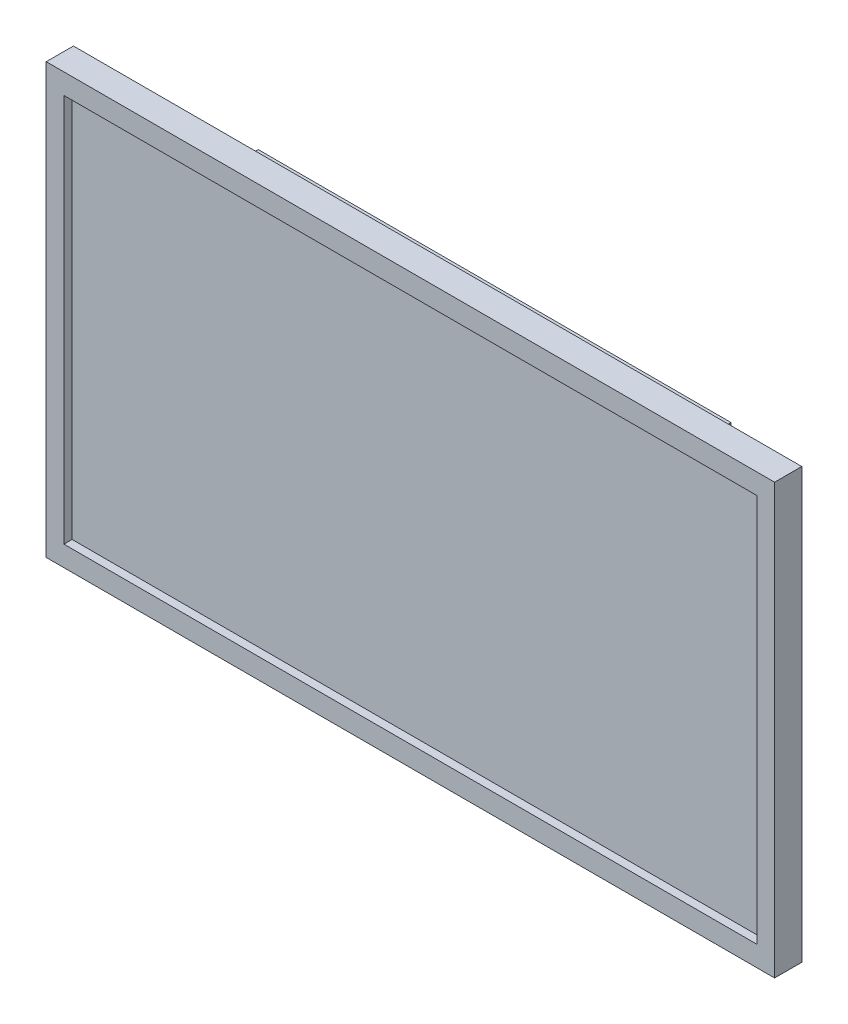
ISO-10303-21;
HEADER;
FILE_DESCRIPTION(('STEP AP214'),'2;1');
FILE_NAME('part.step','',(''),(''),'','','');
FILE_SCHEMA(('AUTOMOTIVE_DESIGN { 1 0 10303 214 1 1 1 1 }'));
ENDSEC;
DATA;
#1=APPLICATION_CONTEXT('core data for automotive mechanical design processes');
#2=APPLICATION_PROTOCOL_DEFINITION('international standard','automotive_design',2000,#1);
#3=PRODUCT_CONTEXT('',#1,'mechanical');
#4=PRODUCT('Part','Part','',(#3));
#5=PRODUCT_RELATED_PRODUCT_CATEGORY('part','',(#4));
#6=PRODUCT_DEFINITION_FORMATION('','',#4);
#7=PRODUCT_DEFINITION_CONTEXT('part definition',#1,'design');
#8=PRODUCT_DEFINITION('design','',#6,#7);
#9=PRODUCT_DEFINITION_SHAPE('','',#8);
#10=(LENGTH_UNIT() NAMED_UNIT(*) SI_UNIT(.MILLI.,.METRE.));
#11=(NAMED_UNIT(*) PLANE_ANGLE_UNIT() SI_UNIT($,.RADIAN.));
#12=(NAMED_UNIT(*) SI_UNIT($,.STERADIAN.) SOLID_ANGLE_UNIT());
#13=UNCERTAINTY_MEASURE_WITH_UNIT(LENGTH_MEASURE(1.E-05),#10,'distance_accuracy_value','');
#14=(GEOMETRIC_REPRESENTATION_CONTEXT(3) GLOBAL_UNCERTAINTY_ASSIGNED_CONTEXT((#13)) GLOBAL_UNIT_ASSIGNED_CONTEXT((#10,
#11,#12)) REPRESENTATION_CONTEXT('',''));
#15=CARTESIAN_POINT('',(0.,0.,0.));
#16=DIRECTION('',(0.,0.,1.));
#17=DIRECTION('',(1.,0.,0.));
#18=AXIS2_PLACEMENT_3D('',#15,#16,#17);
#19=CARTESIAN_POINT('',(134.,79.,-10.));
#20=DIRECTION('',(0.,1.,0.));
#21=DIRECTION('',(0.,0.,1.));
#22=AXIS2_PLACEMENT_3D('',#19,#20,#21);
#23=PLANE('',#22);
#24=DIRECTION('',(-1.,0.,0.));
#25=VECTOR('',#24,1.);
#26=CARTESIAN_POINT('',(134.,79.,0.));
#27=LINE('',#26,#25);
#28=CARTESIAN_POINT('',(134.,79.,0.));
#29=VERTEX_POINT('',#28);
#30=CARTESIAN_POINT('',(-134.,79.,0.));
#31=VERTEX_POINT('',#30);
#32=EDGE_CURVE('E195',#29,#31,#27,.T.);
#33=ORIENTED_EDGE('',*,*,#32,.F.);
#34=DIRECTION('',(0.,0.,1.));
#35=VECTOR('',#34,1.);
#36=CARTESIAN_POINT('',(134.,79.,-10.));
#37=LINE('',#36,#35);
#38=CARTESIAN_POINT('',(134.,79.,-10.));
#39=VERTEX_POINT('',#38);
#40=EDGE_CURVE('E11',#39,#29,#37,.T.);
#41=ORIENTED_EDGE('',*,*,#40,.F.);
#42=DIRECTION('',(-1.,0.,0.));
#43=VECTOR('',#42,1.);
#44=CARTESIAN_POINT('',(134.,79.,-10.));
#45=LINE('',#44,#43);
#46=CARTESIAN_POINT('',(-134.,79.,-10.));
#47=VERTEX_POINT('',#46);
#48=EDGE_CURVE('E196',#39,#47,#45,.T.);
#49=ORIENTED_EDGE('',*,*,#48,.T.);
#50=DIRECTION('',(0.,0.,1.));
#51=VECTOR('',#50,1.);
#52=CARTESIAN_POINT('',(-134.,79.,-10.));
#53=LINE('',#52,#51);
#54=EDGE_CURVE('E38',#47,#31,#53,.T.);
#55=ORIENTED_EDGE('',*,*,#54,.T.);
#56=EDGE_LOOP('',(#33,#41,#49,#55));
#57=FACE_BOUND('',#56,.T.);
#58=ADVANCED_FACE('F35',(#57),#23,.T.);
#59=CARTESIAN_POINT('',(134.,-79.,-10.));
#60=DIRECTION('',(1.,0.,0.));
#61=DIRECTION('',(0.,1.,0.));
#62=AXIS2_PLACEMENT_3D('',#59,#60,#61);
#63=PLANE('',#62);
#64=DIRECTION('',(0.,1.,0.));
#65=VECTOR('',#64,1.);
#66=CARTESIAN_POINT('',(134.,-79.,0.));
#67=LINE('',#66,#65);
#68=CARTESIAN_POINT('',(134.,-79.,0.));
#69=VERTEX_POINT('',#68);
#70=EDGE_CURVE('E200',#69,#29,#67,.T.);
#71=ORIENTED_EDGE('',*,*,#70,.F.);
#72=DIRECTION('',(0.,0.,1.));
#73=VECTOR('',#72,1.);
#74=CARTESIAN_POINT('',(134.,-79.,-10.));
#75=LINE('',#74,#73);
#76=CARTESIAN_POINT('',(134.,-79.,-10.));
#77=VERTEX_POINT('',#76);
#78=EDGE_CURVE('E43',#77,#69,#75,.T.);
#79=ORIENTED_EDGE('',*,*,#78,.F.);
#80=DIRECTION('',(0.,1.,0.));
#81=VECTOR('',#80,1.);
#82=CARTESIAN_POINT('',(134.,-79.,-10.));
#83=LINE('',#82,#81);
#84=EDGE_CURVE('E206',#77,#39,#83,.T.);
#85=ORIENTED_EDGE('',*,*,#84,.T.);
#86=ORIENTED_EDGE('',*,*,#40,.T.);
#87=EDGE_LOOP('',(#71,#79,#85,#86));
#88=FACE_BOUND('',#87,.T.);
#89=ADVANCED_FACE('F232',(#88),#63,.T.);
#90=CARTESIAN_POINT('',(-134.,-79.,-10.));
#91=DIRECTION('',(0.,-1.,0.));
#92=DIRECTION('',(0.,0.,-1.));
#93=AXIS2_PLACEMENT_3D('',#90,#91,#92);
#94=PLANE('',#93);
#95=DIRECTION('',(1.,0.,0.));
#96=VECTOR('',#95,1.);
#97=CARTESIAN_POINT('',(-134.,-79.,0.));
#98=LINE('',#97,#96);
#99=CARTESIAN_POINT('',(-134.,-79.,0.));
#100=VERTEX_POINT('',#99);
#101=EDGE_CURVE('E214',#100,#69,#98,.T.);
#102=ORIENTED_EDGE('',*,*,#101,.F.);
#103=DIRECTION('',(0.,0.,1.));
#104=VECTOR('',#103,1.);
#105=CARTESIAN_POINT('',(-134.,-79.,-10.));
#106=LINE('',#105,#104);
#107=CARTESIAN_POINT('',(-134.,-79.,-10.));
#108=VERTEX_POINT('',#107);
#109=EDGE_CURVE('E219',#108,#100,#106,.T.);
#110=ORIENTED_EDGE('',*,*,#109,.F.);
#111=DIRECTION('',(1.,0.,0.));
#112=VECTOR('',#111,1.);
#113=CARTESIAN_POINT('',(-134.,-79.,-10.));
#114=LINE('',#113,#112);
#115=EDGE_CURVE('E203',#108,#77,#114,.T.);
#116=ORIENTED_EDGE('',*,*,#115,.T.);
#117=ORIENTED_EDGE('',*,*,#78,.T.);
#118=EDGE_LOOP('',(#102,#110,#116,#117));
#119=FACE_BOUND('',#118,.T.);
#120=ADVANCED_FACE('F238',(#119),#94,.T.);
#121=CARTESIAN_POINT('',(-134.,79.,-10.));
#122=DIRECTION('',(-1.,0.,0.));
#123=DIRECTION('',(0.,-1.,0.));
#124=AXIS2_PLACEMENT_3D('',#121,#122,#123);
#125=PLANE('',#124);
#126=DIRECTION('',(0.,-1.,0.));
#127=VECTOR('',#126,1.);
#128=CARTESIAN_POINT('',(-134.,79.,0.));
#129=LINE('',#128,#127);
#130=EDGE_CURVE('E211',#31,#100,#129,.T.);
#131=ORIENTED_EDGE('',*,*,#130,.F.);
#132=ORIENTED_EDGE('',*,*,#54,.F.);
#133=DIRECTION('',(0.,-1.,0.));
#134=VECTOR('',#133,1.);
#135=CARTESIAN_POINT('',(-134.,79.,-10.));
#136=LINE('',#135,#134);
#137=EDGE_CURVE('E199',#47,#108,#136,.T.);
#138=ORIENTED_EDGE('',*,*,#137,.T.);
#139=ORIENTED_EDGE('',*,*,#109,.T.);
#140=EDGE_LOOP('',(#131,#132,#138,#139));
#141=FACE_BOUND('',#140,.T.);
#142=ADVANCED_FACE('F227',(#141),#125,.T.);
#143=CARTESIAN_POINT('',(0.,0.,-10.));
#144=DIRECTION('',(0.,0.,1.));
#145=DIRECTION('',(1.,0.,0.));
#146=AXIS2_PLACEMENT_3D('',#143,#144,#145);
#147=PLANE('',#146);
#148=DIRECTION('',(0.,1.,0.));
#149=VECTOR('',#148,1.);
#150=CARTESIAN_POINT('',(87.,0.,-10.));
#151=LINE('',#150,#149);
#152=CARTESIAN_POINT('',(87.,-59.,-10.));
#153=VERTEX_POINT('',#152);
#154=CARTESIAN_POINT('',(87.,59.,-10.));
#155=VERTEX_POINT('',#154);
#156=EDGE_CURVE('E189',#153,#155,#151,.T.);
#157=ORIENTED_EDGE('',*,*,#156,.T.);
#158=DIRECTION('',(-1.,0.,0.));
#159=VECTOR('',#158,1.);
#160=CARTESIAN_POINT('',(0.,59.,-10.));
#161=LINE('',#160,#159);
#162=CARTESIAN_POINT('',(-87.,59.,-10.));
#163=VERTEX_POINT('',#162);
#164=EDGE_CURVE('E192',#155,#163,#161,.T.);
#165=ORIENTED_EDGE('',*,*,#164,.T.);
#166=DIRECTION('',(0.,-1.,0.));
#167=VECTOR('',#166,1.);
#168=CARTESIAN_POINT('',(-87.,0.,-10.));
#169=LINE('',#168,#167);
#170=CARTESIAN_POINT('',(-87.,-59.,-10.));
#171=VERTEX_POINT('',#170);
#172=EDGE_CURVE('E177',#163,#171,#169,.T.);
#173=ORIENTED_EDGE('',*,*,#172,.T.);
#174=DIRECTION('',(1.,0.,0.));
#175=VECTOR('',#174,1.);
#176=CARTESIAN_POINT('',(0.,-59.,-10.));
#177=LINE('',#176,#175);
#178=EDGE_CURVE('E186',#171,#153,#177,.T.);
#179=ORIENTED_EDGE('',*,*,#178,.T.);
#180=EDGE_LOOP('',(#157,#165,#173,#179));
#181=FACE_BOUND('',#180,.T.);
#182=ORIENTED_EDGE('',*,*,#48,.F.);
#183=ORIENTED_EDGE('',*,*,#84,.F.);
#184=ORIENTED_EDGE('',*,*,#115,.F.);
#185=ORIENTED_EDGE('',*,*,#137,.F.);
#186=EDGE_LOOP('',(#182,#183,#184,#185));
#187=FACE_BOUND('',#186,.T.);
#188=ADVANCED_FACE('F235',(#181,#187),#147,.F.);
#189=CARTESIAN_POINT('',(0.,0.,0.));
#190=DIRECTION('',(0.,0.,1.));
#191=DIRECTION('',(1.,0.,0.));
#192=AXIS2_PLACEMENT_3D('',#189,#190,#191);
#193=PLANE('',#192);
#194=DIRECTION('',(0.,-1.,0.));
#195=VECTOR('',#194,1.);
#196=CARTESIAN_POINT('',(-127.5,71.5,0.));
#197=LINE('',#196,#195);
#198=CARTESIAN_POINT('',(-127.5,71.5,0.));
#199=VERTEX_POINT('',#198);
#200=CARTESIAN_POINT('',(-127.5,-71.5,0.));
#201=VERTEX_POINT('',#200);
#202=EDGE_CURVE('E51',#199,#201,#197,.T.);
#203=ORIENTED_EDGE('',*,*,#202,.F.);
#204=DIRECTION('',(-1.,0.,0.));
#205=VECTOR('',#204,1.);
#206=CARTESIAN_POINT('',(-127.5,71.5,0.));
#207=LINE('',#206,#205);
#208=CARTESIAN_POINT('',(127.5,71.5,0.));
#209=VERTEX_POINT('',#208);
#210=EDGE_CURVE('E144',#209,#199,#207,.T.);
#211=ORIENTED_EDGE('',*,*,#210,.F.);
#212=DIRECTION('',(0.,1.,0.));
#213=VECTOR('',#212,1.);
#214=CARTESIAN_POINT('',(127.5,71.5,0.));
#215=LINE('',#214,#213);
#216=CARTESIAN_POINT('',(127.5,-71.5,0.));
#217=VERTEX_POINT('',#216);
#218=EDGE_CURVE('E147',#217,#209,#215,.T.);
#219=ORIENTED_EDGE('',*,*,#218,.F.);
#220=DIRECTION('',(1.,0.,0.));
#221=VECTOR('',#220,1.);
#222=CARTESIAN_POINT('',(-127.5,-71.5,0.));
#223=LINE('',#222,#221);
#224=EDGE_CURVE('E153',#201,#217,#223,.T.);
#225=ORIENTED_EDGE('',*,*,#224,.F.);
#226=EDGE_LOOP('',(#203,#211,#219,#225));
#227=FACE_BOUND('',#226,.T.);
#228=ORIENTED_EDGE('',*,*,#32,.T.);
#229=ORIENTED_EDGE('',*,*,#130,.T.);
#230=ORIENTED_EDGE('',*,*,#101,.T.);
#231=ORIENTED_EDGE('',*,*,#70,.T.);
#232=EDGE_LOOP('',(#228,#229,#230,#231));
#233=FACE_BOUND('',#232,.T.);
#234=ADVANCED_FACE('F229',(#227,#233),#193,.T.);
#235=CARTESIAN_POINT('',(87.,59.,-31.));
#236=DIRECTION('',(0.,1.,0.));
#237=DIRECTION('',(0.,0.,1.));
#238=AXIS2_PLACEMENT_3D('',#235,#236,#237);
#239=PLANE('',#238);
#240=ORIENTED_EDGE('',*,*,#164,.F.);
#241=DIRECTION('',(0.,0.,1.));
#242=VECTOR('',#241,1.);
#243=CARTESIAN_POINT('',(87.,59.,-31.));
#244=LINE('',#243,#242);
#245=CARTESIAN_POINT('',(87.,59.,-31.));
#246=VERTEX_POINT('',#245);
#247=EDGE_CURVE('E174',#246,#155,#244,.T.);
#248=ORIENTED_EDGE('',*,*,#247,.F.);
#249=DIRECTION('',(-1.,0.,0.));
#250=VECTOR('',#249,1.);
#251=CARTESIAN_POINT('',(87.,59.,-31.));
#252=LINE('',#251,#250);
#253=CARTESIAN_POINT('',(-87.,59.,-31.));
#254=VERTEX_POINT('',#253);
#255=EDGE_CURVE('E159',#246,#254,#252,.T.);
#256=ORIENTED_EDGE('',*,*,#255,.T.);
#257=DIRECTION('',(0.,0.,1.));
#258=VECTOR('',#257,1.);
#259=CARTESIAN_POINT('',(-87.,59.,-31.));
#260=LINE('',#259,#258);
#261=EDGE_CURVE('E173',#254,#163,#260,.T.);
#262=ORIENTED_EDGE('',*,*,#261,.T.);
#263=EDGE_LOOP('',(#240,#248,#256,#262));
#264=FACE_BOUND('',#263,.T.);
#265=ADVANCED_FACE('F279',(#264),#239,.T.);
#266=CARTESIAN_POINT('',(87.,-59.,-31.));
#267=DIRECTION('',(1.,0.,0.));
#268=DIRECTION('',(0.,0.,-1.));
#269=AXIS2_PLACEMENT_3D('',#266,#267,#268);
#270=PLANE('',#269);
#271=ORIENTED_EDGE('',*,*,#156,.F.);
#272=DIRECTION('',(0.,0.,1.));
#273=VECTOR('',#272,1.);
#274=CARTESIAN_POINT('',(87.,-59.,-31.));
#275=LINE('',#274,#273);
#276=CARTESIAN_POINT('',(87.,-59.,-31.));
#277=VERTEX_POINT('',#276);
#278=EDGE_CURVE('E178',#277,#153,#275,.T.);
#279=ORIENTED_EDGE('',*,*,#278,.F.);
#280=DIRECTION('',(0.,1.,0.));
#281=VECTOR('',#280,1.);
#282=CARTESIAN_POINT('',(87.,-59.,-31.));
#283=LINE('',#282,#281);
#284=EDGE_CURVE('E170',#277,#246,#283,.T.);
#285=ORIENTED_EDGE('',*,*,#284,.T.);
#286=ORIENTED_EDGE('',*,*,#247,.T.);
#287=EDGE_LOOP('',(#271,#279,#285,#286));
#288=FACE_BOUND('',#287,.T.);
#289=ADVANCED_FACE('F284',(#288),#270,.T.);
#290=CARTESIAN_POINT('',(-87.,-59.,-31.));
#291=DIRECTION('',(0.,-1.,0.));
#292=DIRECTION('',(0.,0.,-1.));
#293=AXIS2_PLACEMENT_3D('',#290,#291,#292);
#294=PLANE('',#293);
#295=ORIENTED_EDGE('',*,*,#178,.F.);
#296=DIRECTION('',(0.,0.,1.));
#297=VECTOR('',#296,1.);
#298=CARTESIAN_POINT('',(-87.,-59.,-31.));
#299=LINE('',#298,#297);
#300=CARTESIAN_POINT('',(-87.,-59.,-31.));
#301=VERTEX_POINT('',#300);
#302=EDGE_CURVE('E59',#301,#171,#299,.T.);
#303=ORIENTED_EDGE('',*,*,#302,.F.);
#304=DIRECTION('',(1.,0.,0.));
#305=VECTOR('',#304,1.);
#306=CARTESIAN_POINT('',(-87.,-59.,-31.));
#307=LINE('',#306,#305);
#308=EDGE_CURVE('E167',#301,#277,#307,.T.);
#309=ORIENTED_EDGE('',*,*,#308,.T.);
#310=ORIENTED_EDGE('',*,*,#278,.T.);
#311=EDGE_LOOP('',(#295,#303,#309,#310));
#312=FACE_BOUND('',#311,.T.);
#313=ADVANCED_FACE('F294',(#312),#294,.T.);
#314=CARTESIAN_POINT('',(-87.,59.,-31.));
#315=DIRECTION('',(-1.,0.,0.));
#316=DIRECTION('',(0.,0.,1.));
#317=AXIS2_PLACEMENT_3D('',#314,#315,#316);
#318=PLANE('',#317);
#319=ORIENTED_EDGE('',*,*,#172,.F.);
#320=ORIENTED_EDGE('',*,*,#261,.F.);
#321=DIRECTION('',(0.,-1.,0.));
#322=VECTOR('',#321,1.);
#323=CARTESIAN_POINT('',(-87.,59.,-31.));
#324=LINE('',#323,#322);
#325=EDGE_CURVE('E165',#254,#301,#324,.T.);
#326=ORIENTED_EDGE('',*,*,#325,.T.);
#327=ORIENTED_EDGE('',*,*,#302,.T.);
#328=EDGE_LOOP('',(#319,#320,#326,#327));
#329=FACE_BOUND('',#328,.T.);
#330=ADVANCED_FACE('F304',(#329),#318,.T.);
#331=CARTESIAN_POINT('',(0.,0.,-31.));
#332=DIRECTION('',(0.,0.,1.));
#333=DIRECTION('',(1.,0.,0.));
#334=AXIS2_PLACEMENT_3D('',#331,#332,#333);
#335=PLANE('',#334);
#336=ORIENTED_EDGE('',*,*,#255,.F.);
#337=ORIENTED_EDGE('',*,*,#284,.F.);
#338=ORIENTED_EDGE('',*,*,#308,.F.);
#339=ORIENTED_EDGE('',*,*,#325,.F.);
#340=EDGE_LOOP('',(#336,#337,#338,#339));
#341=FACE_BOUND('',#340,.T.);
#342=ADVANCED_FACE('F314',(#341),#335,.F.);
#343=CARTESIAN_POINT('',(-127.5,71.5,-3.));
#344=DIRECTION('',(-1.,0.,0.));
#345=DIRECTION('',(0.,0.,1.));
#346=AXIS2_PLACEMENT_3D('',#343,#344,#345);
#347=PLANE('',#346);
#348=ORIENTED_EDGE('',*,*,#202,.T.);
#349=DIRECTION('',(0.,0.,1.));
#350=VECTOR('',#349,1.);
#351=CARTESIAN_POINT('',(-127.5,-71.5,-3.));
#352=LINE('',#351,#350);
#353=CARTESIAN_POINT('',(-127.5,-71.5,-3.));
#354=VERTEX_POINT('',#353);
#355=EDGE_CURVE('E122',#354,#201,#352,.T.);
#356=ORIENTED_EDGE('',*,*,#355,.F.);
#357=DIRECTION('',(0.,-1.,0.));
#358=VECTOR('',#357,1.);
#359=CARTESIAN_POINT('',(-127.5,71.5,-3.));
#360=LINE('',#359,#358);
#361=CARTESIAN_POINT('',(-127.5,71.5,-3.));
#362=VERTEX_POINT('',#361);
#363=EDGE_CURVE('E126',#362,#354,#360,.T.);
#364=ORIENTED_EDGE('',*,*,#363,.F.);
#365=DIRECTION('',(0.,0.,1.));
#366=VECTOR('',#365,1.);
#367=CARTESIAN_POINT('',(-127.5,71.5,-3.));
#368=LINE('',#367,#366);
#369=EDGE_CURVE('E157',#362,#199,#368,.T.);
#370=ORIENTED_EDGE('',*,*,#369,.T.);
#371=EDGE_LOOP('',(#348,#356,#364,#370));
#372=FACE_BOUND('',#371,.T.);
#373=ADVANCED_FACE('F124',(#372),#347,.F.);
#374=CARTESIAN_POINT('',(-127.5,71.5,-3.));
#375=DIRECTION('',(0.,1.,0.));
#376=DIRECTION('',(0.,0.,1.));
#377=AXIS2_PLACEMENT_3D('',#374,#375,#376);
#378=PLANE('',#377);
#379=ORIENTED_EDGE('',*,*,#210,.T.);
#380=ORIENTED_EDGE('',*,*,#369,.F.);
#381=DIRECTION('',(-1.,0.,0.));
#382=VECTOR('',#381,1.);
#383=CARTESIAN_POINT('',(-127.5,71.5,-3.));
#384=LINE('',#383,#382);
#385=CARTESIAN_POINT('',(127.5,71.5,-3.));
#386=VERTEX_POINT('',#385);
#387=EDGE_CURVE('E132',#386,#362,#384,.T.);
#388=ORIENTED_EDGE('',*,*,#387,.F.);
#389=DIRECTION('',(0.,0.,1.));
#390=VECTOR('',#389,1.);
#391=CARTESIAN_POINT('',(127.5,71.5,-3.));
#392=LINE('',#391,#390);
#393=EDGE_CURVE('E160',#386,#209,#392,.T.);
#394=ORIENTED_EDGE('',*,*,#393,.T.);
#395=EDGE_LOOP('',(#379,#380,#388,#394));
#396=FACE_BOUND('',#395,.T.);
#397=ADVANCED_FACE('F339',(#396),#378,.F.);
#398=CARTESIAN_POINT('',(127.5,71.5,-3.));
#399=DIRECTION('',(1.,0.,0.));
#400=DIRECTION('',(0.,0.,-1.));
#401=AXIS2_PLACEMENT_3D('',#398,#399,#400);
#402=PLANE('',#401);
#403=ORIENTED_EDGE('',*,*,#218,.T.);
#404=ORIENTED_EDGE('',*,*,#393,.F.);
#405=DIRECTION('',(0.,1.,0.));
#406=VECTOR('',#405,1.);
#407=CARTESIAN_POINT('',(127.5,71.5,-3.));
#408=LINE('',#407,#406);
#409=CARTESIAN_POINT('',(127.5,-71.5,-3.));
#410=VERTEX_POINT('',#409);
#411=EDGE_CURVE('E140',#410,#386,#408,.T.);
#412=ORIENTED_EDGE('',*,*,#411,.F.);
#413=DIRECTION('',(0.,0.,1.));
#414=VECTOR('',#413,1.);
#415=CARTESIAN_POINT('',(127.5,-71.5,-3.));
#416=LINE('',#415,#414);
#417=EDGE_CURVE('E131',#410,#217,#416,.T.);
#418=ORIENTED_EDGE('',*,*,#417,.T.);
#419=EDGE_LOOP('',(#403,#404,#412,#418));
#420=FACE_BOUND('',#419,.T.);
#421=ADVANCED_FACE('F348',(#420),#402,.F.);
#422=CARTESIAN_POINT('',(-127.5,-71.5,-3.));
#423=DIRECTION('',(0.,-1.,0.));
#424=DIRECTION('',(0.,0.,-1.));
#425=AXIS2_PLACEMENT_3D('',#422,#423,#424);
#426=PLANE('',#425);
#427=ORIENTED_EDGE('',*,*,#224,.T.);
#428=ORIENTED_EDGE('',*,*,#417,.F.);
#429=DIRECTION('',(1.,0.,0.));
#430=VECTOR('',#429,1.);
#431=CARTESIAN_POINT('',(-127.5,-71.5,-3.));
#432=LINE('',#431,#430);
#433=EDGE_CURVE('E135',#354,#410,#432,.T.);
#434=ORIENTED_EDGE('',*,*,#433,.F.);
#435=ORIENTED_EDGE('',*,*,#355,.T.);
#436=EDGE_LOOP('',(#427,#428,#434,#435));
#437=FACE_BOUND('',#436,.T.);
#438=ADVANCED_FACE('F136',(#437),#426,.F.);
#439=CARTESIAN_POINT('',(0.,0.,-3.));
#440=DIRECTION('',(0.,0.,1.));
#441=DIRECTION('',(1.,0.,0.));
#442=AXIS2_PLACEMENT_3D('',#439,#440,#441);
#443=PLANE('',#442);
#444=ORIENTED_EDGE('',*,*,#363,.T.);
#445=ORIENTED_EDGE('',*,*,#433,.T.);
#446=ORIENTED_EDGE('',*,*,#411,.T.);
#447=ORIENTED_EDGE('',*,*,#387,.T.);
#448=EDGE_LOOP('',(#444,#445,#446,#447));
#449=FACE_BOUND('',#448,.T.);
#450=ADVANCED_FACE('F142',(#449),#443,.T.);
#451=CLOSED_SHELL('',(#58,#89,#120,#142,#188,#234,#265,#289,#313,#330,#342,#373,#397,#421,#438,#450));
#452=MANIFOLD_SOLID_BREP('B2',#451);
#453=ADVANCED_BREP_SHAPE_REPRESENTATION('',(#18,#452),#14);
#454=SHAPE_DEFINITION_REPRESENTATION(#9,#453);
ENDSEC;
END-ISO-10303-21;
